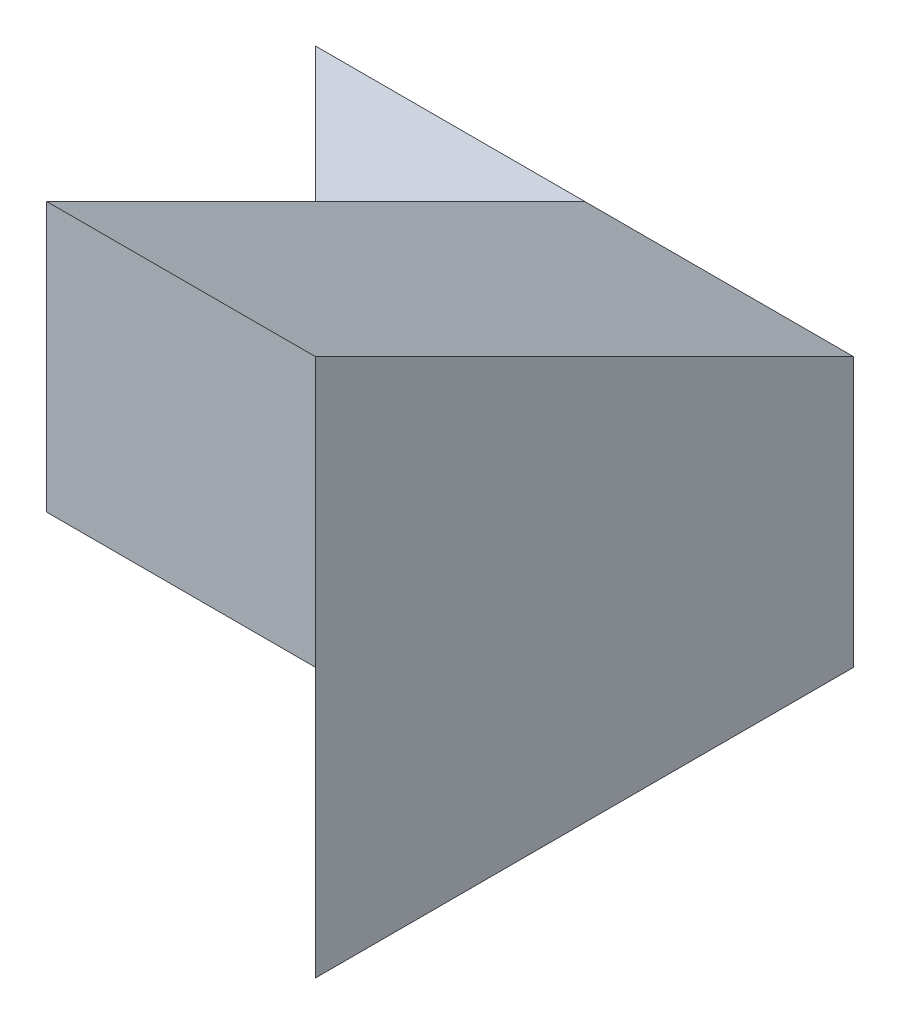
ISO-10303-21;
HEADER;
FILE_DESCRIPTION(('STEP AP214'),'2;1');
FILE_NAME('part.step','',(''),(''),'','','');
FILE_SCHEMA(('AUTOMOTIVE_DESIGN { 1 0 10303 214 1 1 1 1 }'));
ENDSEC;
DATA;
#1=APPLICATION_CONTEXT('core data for automotive mechanical design processes');
#2=APPLICATION_PROTOCOL_DEFINITION('international standard','automotive_design',2000,#1);
#3=PRODUCT_CONTEXT('',#1,'mechanical');
#4=PRODUCT('Part','Part','',(#3));
#5=PRODUCT_RELATED_PRODUCT_CATEGORY('part','',(#4));
#6=PRODUCT_DEFINITION_FORMATION('','',#4);
#7=PRODUCT_DEFINITION_CONTEXT('part definition',#1,'design');
#8=PRODUCT_DEFINITION('design','',#6,#7);
#9=PRODUCT_DEFINITION_SHAPE('','',#8);
#10=(LENGTH_UNIT() NAMED_UNIT(*) SI_UNIT(.MILLI.,.METRE.));
#11=(NAMED_UNIT(*) PLANE_ANGLE_UNIT() SI_UNIT($,.RADIAN.));
#12=(NAMED_UNIT(*) SI_UNIT($,.STERADIAN.) SOLID_ANGLE_UNIT());
#13=UNCERTAINTY_MEASURE_WITH_UNIT(LENGTH_MEASURE(1.E-05),#10,'distance_accuracy_value','');
#14=(GEOMETRIC_REPRESENTATION_CONTEXT(3) GLOBAL_UNCERTAINTY_ASSIGNED_CONTEXT((#13)) GLOBAL_UNIT_ASSIGNED_CONTEXT((#10,
#11,#12)) REPRESENTATION_CONTEXT('',''));
#15=CARTESIAN_POINT('',(0.,0.,0.));
#16=DIRECTION('',(0.,0.,1.));
#17=DIRECTION('',(1.,0.,0.));
#18=AXIS2_PLACEMENT_3D('',#15,#16,#17);
#19=CARTESIAN_POINT('',(0.,0.,40.));
#20=DIRECTION('',(0.,1.,0.));
#21=DIRECTION('',(0.,0.,1.));
#22=AXIS2_PLACEMENT_3D('',#19,#20,#21);
#23=PLANE('',#22);
#24=DIRECTION('',(0.,0.,-1.));
#25=VECTOR('',#24,1.);
#26=CARTESIAN_POINT('',(40.,0.,40.));
#27=LINE('',#26,#25);
#28=CARTESIAN_POINT('',(40.,0.,40.));
#29=VERTEX_POINT('',#28);
#30=CARTESIAN_POINT('',(40.,0.,0.));
#31=VERTEX_POINT('',#30);
#32=EDGE_CURVE('E40',#29,#31,#27,.T.);
#33=ORIENTED_EDGE('',*,*,#32,.F.);
#34=DIRECTION('',(-0.707106781186548,0.,-0.707106781186547));
#35=VECTOR('',#34,1.);
#36=CARTESIAN_POINT('',(0.,0.,0.));
#37=LINE('',#36,#35);
#38=CARTESIAN_POINT('',(0.,0.,0.));
#39=VERTEX_POINT('',#38);
#40=EDGE_CURVE('E87',#29,#39,#37,.T.);
#41=ORIENTED_EDGE('',*,*,#40,.T.);
#42=DIRECTION('',(1.,0.,0.));
#43=VECTOR('',#42,1.);
#44=CARTESIAN_POINT('',(0.,0.,0.));
#45=LINE('',#44,#43);
#46=EDGE_CURVE('E111',#39,#31,#45,.T.);
#47=ORIENTED_EDGE('',*,*,#46,.T.);
#48=EDGE_LOOP('',(#33,#41,#47));
#49=FACE_BOUND('',#48,.T.);
#50=ADVANCED_FACE('F33',(#49),#23,.F.);
#51=CARTESIAN_POINT('',(0.,0.,40.));
#52=DIRECTION('',(0.,0.,-1.));
#53=DIRECTION('',(-1.,0.,0.));
#54=AXIS2_PLACEMENT_3D('',#51,#52,#53);
#55=PLANE('',#54);
#56=DIRECTION('',(-1.,0.,0.));
#57=VECTOR('',#56,1.);
#58=CARTESIAN_POINT('',(0.,20.,40.));
#59=LINE('',#58,#57);
#60=CARTESIAN_POINT('',(40.,20.,40.));
#61=VERTEX_POINT('',#60);
#62=CARTESIAN_POINT('',(20.,20.,40.));
#63=VERTEX_POINT('',#62);
#64=EDGE_CURVE('E97',#61,#63,#59,.T.);
#65=ORIENTED_EDGE('',*,*,#64,.F.);
#66=DIRECTION('',(0.,1.,0.));
#67=VECTOR('',#66,1.);
#68=CARTESIAN_POINT('',(40.,0.,40.));
#69=LINE('',#68,#67);
#70=CARTESIAN_POINT('',(40.,40.,40.));
#71=VERTEX_POINT('',#70);
#72=EDGE_CURVE('E93',#61,#71,#69,.T.);
#73=ORIENTED_EDGE('',*,*,#72,.T.);
#74=DIRECTION('',(-1.,0.,0.));
#75=VECTOR('',#74,1.);
#76=CARTESIAN_POINT('',(0.,40.,40.));
#77=LINE('',#76,#75);
#78=CARTESIAN_POINT('',(20.,40.,40.));
#79=VERTEX_POINT('',#78);
#80=EDGE_CURVE('E92',#71,#79,#77,.T.);
#81=ORIENTED_EDGE('',*,*,#80,.T.);
#82=DIRECTION('',(0.,1.,0.));
#83=VECTOR('',#82,1.);
#84=CARTESIAN_POINT('',(20.,40.,40.));
#85=LINE('',#84,#83);
#86=EDGE_CURVE('E104',#63,#79,#85,.T.);
#87=ORIENTED_EDGE('',*,*,#86,.F.);
#88=EDGE_LOOP('',(#65,#73,#81,#87));
#89=FACE_BOUND('',#88,.T.);
#90=ADVANCED_FACE('F101',(#89),#55,.F.);
#91=CARTESIAN_POINT('',(20.,40.,0.));
#92=DIRECTION('',(1.,0.,0.));
#93=DIRECTION('',(0.,1.,0.));
#94=AXIS2_PLACEMENT_3D('',#91,#92,#93);
#95=PLANE('',#94);
#96=DIRECTION('',(0.,0.,-1.));
#97=VECTOR('',#96,1.);
#98=CARTESIAN_POINT('',(20.,20.,0.));
#99=LINE('',#98,#97);
#100=CARTESIAN_POINT('',(20.,20.,20.));
#101=VERTEX_POINT('',#100);
#102=EDGE_CURVE('E47',#63,#101,#99,.T.);
#103=ORIENTED_EDGE('',*,*,#102,.F.);
#104=ORIENTED_EDGE('',*,*,#86,.T.);
#105=DIRECTION('',(0.,0.447213595499958,0.894427190999916));
#106=VECTOR('',#105,1.);
#107=CARTESIAN_POINT('',(20.,20.,0.));
#108=LINE('',#107,#106);
#109=CARTESIAN_POINT('',(20.,20.,0.));
#110=VERTEX_POINT('',#109);
#111=EDGE_CURVE('E129',#110,#79,#108,.T.);
#112=ORIENTED_EDGE('',*,*,#111,.F.);
#113=DIRECTION('',(0.,0.,1.));
#114=VECTOR('',#113,1.);
#115=CARTESIAN_POINT('',(20.,20.,0.));
#116=LINE('',#115,#114);
#117=EDGE_CURVE('E115',#110,#101,#116,.T.);
#118=ORIENTED_EDGE('',*,*,#117,.T.);
#119=EDGE_LOOP('',(#103,#104,#112,#118));
#120=FACE_BOUND('',#119,.T.);
#121=ADVANCED_FACE('F136',(#120),#95,.F.);
#122=CARTESIAN_POINT('',(0.,20.,0.));
#123=DIRECTION('',(0.,-1.,0.));
#124=DIRECTION('',(0.,0.,-1.));
#125=AXIS2_PLACEMENT_3D('',#122,#123,#124);
#126=PLANE('',#125);
#127=DIRECTION('',(-0.707106781186548,0.,-0.707106781186547));
#128=VECTOR('',#127,1.);
#129=CARTESIAN_POINT('',(0.,20.,0.));
#130=LINE('',#129,#128);
#131=CARTESIAN_POINT('',(0.,20.,0.));
#132=VERTEX_POINT('',#131);
#133=EDGE_CURVE('E11',#101,#132,#130,.T.);
#134=ORIENTED_EDGE('',*,*,#133,.F.);
#135=ORIENTED_EDGE('',*,*,#117,.F.);
#136=DIRECTION('',(1.,0.,0.));
#137=VECTOR('',#136,1.);
#138=CARTESIAN_POINT('',(0.,20.,0.));
#139=LINE('',#138,#137);
#140=EDGE_CURVE('E128',#132,#110,#139,.T.);
#141=ORIENTED_EDGE('',*,*,#140,.F.);
#142=EDGE_LOOP('',(#134,#135,#141));
#143=FACE_BOUND('',#142,.T.);
#144=ADVANCED_FACE('F157',(#143),#126,.F.);
#145=CARTESIAN_POINT('',(40.,0.,40.));
#146=DIRECTION('',(-1.,0.,0.));
#147=DIRECTION('',(0.,0.,1.));
#148=AXIS2_PLACEMENT_3D('',#145,#146,#147);
#149=PLANE('',#148);
#150=DIRECTION('',(0.,1.,0.));
#151=VECTOR('',#150,1.);
#152=CARTESIAN_POINT('',(40.,0.,0.));
#153=LINE('',#152,#151);
#154=CARTESIAN_POINT('',(40.,20.,0.));
#155=VERTEX_POINT('',#154);
#156=EDGE_CURVE('E110',#31,#155,#153,.T.);
#157=ORIENTED_EDGE('',*,*,#156,.T.);
#158=DIRECTION('',(0.,0.447213595499958,0.894427190999916));
#159=VECTOR('',#158,1.);
#160=CARTESIAN_POINT('',(40.,32.,24.));
#161=LINE('',#160,#159);
#162=EDGE_CURVE('E109',#155,#71,#161,.T.);
#163=ORIENTED_EDGE('',*,*,#162,.T.);
#164=ORIENTED_EDGE('',*,*,#72,.F.);
#165=EDGE_CURVE('E82',#29,#61,#69,.T.);
#166=ORIENTED_EDGE('',*,*,#165,.F.);
#167=ORIENTED_EDGE('',*,*,#32,.T.);
#168=EDGE_LOOP('',(#157,#163,#164,#166,#167));
#169=FACE_BOUND('',#168,.T.);
#170=ADVANCED_FACE('F108',(#169),#149,.F.);
#171=CARTESIAN_POINT('',(0.,0.,0.));
#172=DIRECTION('',(0.,0.,-1.));
#173=DIRECTION('',(-1.,0.,0.));
#174=AXIS2_PLACEMENT_3D('',#171,#172,#173);
#175=PLANE('',#174);
#176=DIRECTION('',(-1.,0.,0.));
#177=VECTOR('',#176,1.);
#178=CARTESIAN_POINT('',(60.,20.,0.));
#179=LINE('',#178,#177);
#180=EDGE_CURVE('E55',#155,#110,#179,.T.);
#181=ORIENTED_EDGE('',*,*,#180,.F.);
#182=ORIENTED_EDGE('',*,*,#156,.F.);
#183=ORIENTED_EDGE('',*,*,#46,.F.);
#184=DIRECTION('',(0.,-1.,0.));
#185=VECTOR('',#184,1.);
#186=CARTESIAN_POINT('',(0.,0.,0.));
#187=LINE('',#186,#185);
#188=EDGE_CURVE('E118',#132,#39,#187,.T.);
#189=ORIENTED_EDGE('',*,*,#188,.F.);
#190=ORIENTED_EDGE('',*,*,#140,.T.);
#191=EDGE_LOOP('',(#181,#182,#183,#189,#190));
#192=FACE_BOUND('',#191,.T.);
#193=ADVANCED_FACE('F124',(#192),#175,.T.);
#194=CARTESIAN_POINT('',(60.,20.,0.));
#195=DIRECTION('',(0.,-0.894427190999916,0.447213595499958));
#196=DIRECTION('',(0.,-0.447213595499958,-0.894427190999916));
#197=AXIS2_PLACEMENT_3D('',#194,#195,#196);
#198=PLANE('',#197);
#199=ORIENTED_EDGE('',*,*,#180,.T.);
#200=ORIENTED_EDGE('',*,*,#111,.T.);
#201=ORIENTED_EDGE('',*,*,#80,.F.);
#202=ORIENTED_EDGE('',*,*,#162,.F.);
#203=EDGE_LOOP('',(#199,#200,#201,#202));
#204=FACE_BOUND('',#203,.T.);
#205=ADVANCED_FACE('F139',(#204),#198,.F.);
#206=CARTESIAN_POINT('',(0.,40.,0.));
#207=DIRECTION('',(-0.707106781186547,0.,0.707106781186548));
#208=DIRECTION('',(0.707106781186548,0.,0.707106781186547));
#209=AXIS2_PLACEMENT_3D('',#206,#207,#208);
#210=PLANE('',#209);
#211=ORIENTED_EDGE('',*,*,#133,.T.);
#212=ORIENTED_EDGE('',*,*,#188,.T.);
#213=ORIENTED_EDGE('',*,*,#40,.F.);
#214=ORIENTED_EDGE('',*,*,#165,.T.);
#215=DIRECTION('',(-0.707106781186547,0.,-0.707106781186547));
#216=VECTOR('',#215,1.);
#217=CARTESIAN_POINT('',(0.,20.,0.));
#218=LINE('',#217,#216);
#219=EDGE_CURVE('E84',#61,#101,#218,.T.);
#220=ORIENTED_EDGE('',*,*,#219,.T.);
#221=EDGE_LOOP('',(#211,#212,#213,#214,#220));
#222=FACE_BOUND('',#221,.T.);
#223=ADVANCED_FACE('F83',(#222),#210,.T.);
#224=CARTESIAN_POINT('',(-14.1421356237309,20.,14.142135623731));
#225=DIRECTION('',(0.,-1.,0.));
#226=DIRECTION('',(0.,0.,-1.));
#227=AXIS2_PLACEMENT_3D('',#224,#225,#226);
#228=PLANE('',#227);
#229=ORIENTED_EDGE('',*,*,#64,.T.);
#230=ORIENTED_EDGE('',*,*,#102,.T.);
#231=ORIENTED_EDGE('',*,*,#219,.F.);
#232=EDGE_LOOP('',(#229,#230,#231));
#233=FACE_BOUND('',#232,.T.);
#234=ADVANCED_FACE('F96',(#233),#228,.T.);
#235=CLOSED_SHELL('',(#50,#90,#121,#144,#170,#193,#205,#223,#234));
#236=MANIFOLD_SOLID_BREP('B2',#235);
#237=ADVANCED_BREP_SHAPE_REPRESENTATION('',(#18,#236),#14);
#238=SHAPE_DEFINITION_REPRESENTATION(#9,#237);
ENDSEC;
END-ISO-10303-21;
